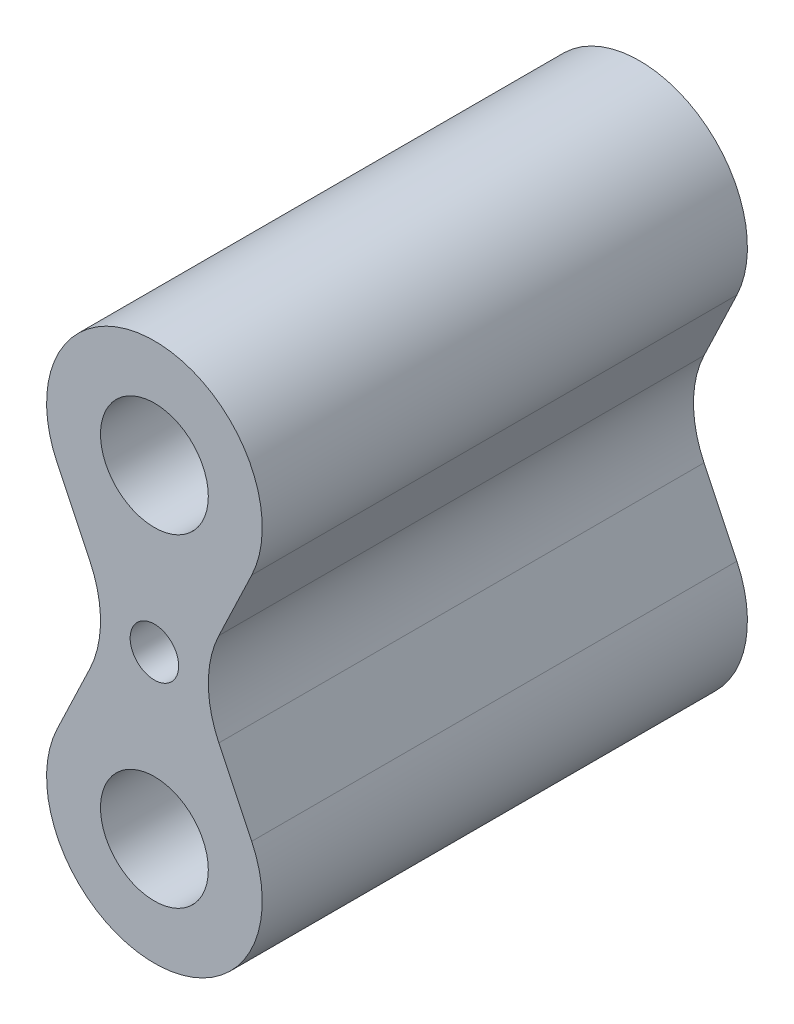
ISO-10303-21;
HEADER;
FILE_DESCRIPTION(('STEP AP214'),'2;1');
FILE_NAME('part.step','',(''),(''),'','','');
FILE_SCHEMA(('AUTOMOTIVE_DESIGN { 1 0 10303 214 1 1 1 1 }'));
ENDSEC;
DATA;
#1=APPLICATION_CONTEXT('core data for automotive mechanical design processes');
#2=APPLICATION_PROTOCOL_DEFINITION('international standard','automotive_design',2000,#1);
#3=PRODUCT_CONTEXT('',#1,'mechanical');
#4=PRODUCT('Part','Part','',(#3));
#5=PRODUCT_RELATED_PRODUCT_CATEGORY('part','',(#4));
#6=PRODUCT_DEFINITION_FORMATION('','',#4);
#7=PRODUCT_DEFINITION_CONTEXT('part definition',#1,'design');
#8=PRODUCT_DEFINITION('design','',#6,#7);
#9=PRODUCT_DEFINITION_SHAPE('','',#8);
#10=(LENGTH_UNIT() NAMED_UNIT(*) SI_UNIT(.MILLI.,.METRE.));
#11=(NAMED_UNIT(*) PLANE_ANGLE_UNIT() SI_UNIT($,.RADIAN.));
#12=(NAMED_UNIT(*) SI_UNIT($,.STERADIAN.) SOLID_ANGLE_UNIT());
#13=UNCERTAINTY_MEASURE_WITH_UNIT(LENGTH_MEASURE(1.E-05),#10,'distance_accuracy_value','');
#14=(GEOMETRIC_REPRESENTATION_CONTEXT(3) GLOBAL_UNCERTAINTY_ASSIGNED_CONTEXT((#13)) GLOBAL_UNIT_ASSIGNED_CONTEXT((#10,
#11,#12)) REPRESENTATION_CONTEXT('',''));
#15=CARTESIAN_POINT('',(0.,0.,0.));
#16=DIRECTION('',(0.,0.,1.));
#17=DIRECTION('',(1.,0.,0.));
#18=AXIS2_PLACEMENT_3D('',#15,#16,#17);
#19=CARTESIAN_POINT('',(0.,30.,45.));
#20=DIRECTION('',(0.,0.,1.));
#21=DIRECTION('',(1.,0.,0.));
#22=AXIS2_PLACEMENT_3D('',#19,#20,#21);
#23=PLANE('',#22);
#24=CARTESIAN_POINT('',(0.,0.,45.));
#25=DIRECTION('',(0.,0.,1.));
#26=DIRECTION('',(1.,0.,0.));
#27=AXIS2_PLACEMENT_3D('',#24,#25,#26);
#28=CIRCLE('',#27,4.49999999999999);
#29=CARTESIAN_POINT('',(4.49999999999999,0.,45.));
#30=VERTEX_POINT('',#29);
#31=EDGE_CURVE('E194',#30,#30,#28,.T.);
#32=ORIENTED_EDGE('',*,*,#31,.F.);
#33=EDGE_LOOP('',(#32));
#34=FACE_BOUND('',#33,.T.);
#35=CARTESIAN_POINT('',(0.,30.,45.));
#36=DIRECTION('',(0.,0.,1.));
#37=DIRECTION('',(1.,0.,0.));
#38=AXIS2_PLACEMENT_3D('',#35,#36,#37);
#39=CIRCLE('',#38,10.);
#40=CARTESIAN_POINT('',(10.,30.,45.));
#41=VERTEX_POINT('',#40);
#42=EDGE_CURVE('E135',#41,#41,#39,.T.);
#43=ORIENTED_EDGE('',*,*,#42,.F.);
#44=EDGE_LOOP('',(#43));
#45=FACE_BOUND('',#44,.T.);
#46=CARTESIAN_POINT('',(0.,30.,45.));
#47=DIRECTION('',(0.,0.,1.));
#48=DIRECTION('',(1.,0.,0.));
#49=AXIS2_PLACEMENT_3D('',#46,#47,#48);
#50=CIRCLE('',#49,20.);
#51=CARTESIAN_POINT('',(18.0473785412436,21.380711874577,45.));
#52=VERTEX_POINT('',#51);
#53=CARTESIAN_POINT('',(-18.0473785412436,21.380711874577,45.));
#54=VERTEX_POINT('',#53);
#55=EDGE_CURVE('E146',#52,#54,#50,.T.);
#56=ORIENTED_EDGE('',*,*,#55,.T.);
#57=DIRECTION('',(0.430964406271149,-0.902368927062183,0.));
#58=VECTOR('',#57,1.);
#59=CARTESIAN_POINT('',(-18.0473785412436,21.380711874577,45.));
#60=LINE('',#59,#58);
#61=CARTESIAN_POINT('',(-11.9526214587564,8.61928812542301,45.));
#62=VERTEX_POINT('',#61);
#63=EDGE_CURVE('E94',#54,#62,#60,.T.);
#64=ORIENTED_EDGE('',*,*,#63,.T.);
#65=CARTESIAN_POINT('',(-30.,0.,45.));
#66=DIRECTION('',(0.,0.,-1.));
#67=DIRECTION('',(1.,0.,0.));
#68=AXIS2_PLACEMENT_3D('',#65,#66,#67);
#69=CIRCLE('',#68,20.);
#70=CARTESIAN_POINT('',(-11.9526214587564,-8.61928812542302,45.));
#71=VERTEX_POINT('',#70);
#72=EDGE_CURVE('E161',#62,#71,#69,.T.);
#73=ORIENTED_EDGE('',*,*,#72,.T.);
#74=DIRECTION('',(-0.430964406271151,-0.902368927062183,0.));
#75=VECTOR('',#74,1.);
#76=CARTESIAN_POINT('',(-11.9526214587563,-8.61928812542302,45.));
#77=LINE('',#76,#75);
#78=CARTESIAN_POINT('',(-18.0473785412436,-21.380711874577,45.));
#79=VERTEX_POINT('',#78);
#80=EDGE_CURVE('E174',#71,#79,#77,.T.);
#81=ORIENTED_EDGE('',*,*,#80,.T.);
#82=CARTESIAN_POINT('',(0.,-30.,45.));
#83=DIRECTION('',(0.,0.,1.));
#84=DIRECTION('',(1.,0.,0.));
#85=AXIS2_PLACEMENT_3D('',#82,#83,#84);
#86=CIRCLE('',#85,20.);
#87=CARTESIAN_POINT('',(18.0473785412436,-21.380711874577,45.));
#88=VERTEX_POINT('',#87);
#89=EDGE_CURVE('E113',#79,#88,#86,.T.);
#90=ORIENTED_EDGE('',*,*,#89,.T.);
#91=DIRECTION('',(-0.430964406271151,0.902368927062182,0.));
#92=VECTOR('',#91,1.);
#93=CARTESIAN_POINT('',(11.9526214587563,-8.61928812542302,45.));
#94=LINE('',#93,#92);
#95=CARTESIAN_POINT('',(11.9526214587563,-8.61928812542302,45.));
#96=VERTEX_POINT('',#95);
#97=EDGE_CURVE('E107',#88,#96,#94,.T.);
#98=ORIENTED_EDGE('',*,*,#97,.T.);
#99=CARTESIAN_POINT('',(30.,0.,45.));
#100=DIRECTION('',(0.,0.,-1.));
#101=DIRECTION('',(1.,0.,0.));
#102=AXIS2_PLACEMENT_3D('',#99,#100,#101);
#103=CIRCLE('',#102,20.);
#104=CARTESIAN_POINT('',(11.9526214587563,8.61928812542301,45.));
#105=VERTEX_POINT('',#104);
#106=EDGE_CURVE('E111',#96,#105,#103,.T.);
#107=ORIENTED_EDGE('',*,*,#106,.T.);
#108=DIRECTION('',(0.430964406271151,0.902368927062183,0.));
#109=VECTOR('',#108,1.);
#110=CARTESIAN_POINT('',(18.0473785412436,21.380711874577,45.));
#111=LINE('',#110,#109);
#112=EDGE_CURVE('E51',#105,#52,#111,.T.);
#113=ORIENTED_EDGE('',*,*,#112,.T.);
#114=EDGE_LOOP('',(#56,#64,#73,#81,#90,#98,#107,#113));
#115=FACE_BOUND('',#114,.T.);
#116=CARTESIAN_POINT('',(0.,-30.,45.));
#117=DIRECTION('',(0.,0.,1.));
#118=DIRECTION('',(1.,0.,0.));
#119=AXIS2_PLACEMENT_3D('',#116,#117,#118);
#120=CIRCLE('',#119,10.);
#121=CARTESIAN_POINT('',(10.,-30.,45.));
#122=VERTEX_POINT('',#121);
#123=EDGE_CURVE('E183',#122,#122,#120,.T.);
#124=ORIENTED_EDGE('',*,*,#123,.F.);
#125=EDGE_LOOP('',(#124));
#126=FACE_BOUND('',#125,.T.);
#127=ADVANCED_FACE('F34',(#34,#45,#115,#126),#23,.T.);
#128=CARTESIAN_POINT('',(0.,30.,-45.));
#129=DIRECTION('',(0.,0.,1.));
#130=DIRECTION('',(1.,0.,0.));
#131=AXIS2_PLACEMENT_3D('',#128,#129,#130);
#132=PLANE('',#131);
#133=CARTESIAN_POINT('',(0.,0.,-45.));
#134=DIRECTION('',(0.,0.,1.));
#135=DIRECTION('',(1.,0.,0.));
#136=AXIS2_PLACEMENT_3D('',#133,#134,#135);
#137=CIRCLE('',#136,4.49999999999998);
#138=CARTESIAN_POINT('',(4.49999999999998,0.,-45.));
#139=VERTEX_POINT('',#138);
#140=EDGE_CURVE('E189',#139,#139,#137,.T.);
#141=ORIENTED_EDGE('',*,*,#140,.T.);
#142=EDGE_LOOP('',(#141));
#143=FACE_BOUND('',#142,.T.);
#144=CARTESIAN_POINT('',(0.,30.,-45.));
#145=DIRECTION('',(0.,0.,1.));
#146=DIRECTION('',(1.,0.,0.));
#147=AXIS2_PLACEMENT_3D('',#144,#145,#146);
#148=CIRCLE('',#147,20.);
#149=CARTESIAN_POINT('',(18.0473785412436,21.380711874577,-45.));
#150=VERTEX_POINT('',#149);
#151=CARTESIAN_POINT('',(-18.0473785412436,21.380711874577,-45.));
#152=VERTEX_POINT('',#151);
#153=EDGE_CURVE('E131',#150,#152,#148,.T.);
#154=ORIENTED_EDGE('',*,*,#153,.F.);
#155=DIRECTION('',(0.430964406271151,0.902368927062183,0.));
#156=VECTOR('',#155,1.);
#157=CARTESIAN_POINT('',(18.0473785412436,21.380711874577,-45.));
#158=LINE('',#157,#156);
#159=CARTESIAN_POINT('',(11.9526214587563,8.61928812542301,-45.));
#160=VERTEX_POINT('',#159);
#161=EDGE_CURVE('E86',#160,#150,#158,.T.);
#162=ORIENTED_EDGE('',*,*,#161,.F.);
#163=CARTESIAN_POINT('',(30.,0.,-45.));
#164=DIRECTION('',(0.,0.,-1.));
#165=DIRECTION('',(1.,0.,0.));
#166=AXIS2_PLACEMENT_3D('',#163,#164,#165);
#167=CIRCLE('',#166,20.);
#168=CARTESIAN_POINT('',(11.9526214587563,-8.61928812542302,-45.));
#169=VERTEX_POINT('',#168);
#170=EDGE_CURVE('E80',#169,#160,#167,.T.);
#171=ORIENTED_EDGE('',*,*,#170,.F.);
#172=DIRECTION('',(-0.430964406271151,0.902368927062182,0.));
#173=VECTOR('',#172,1.);
#174=CARTESIAN_POINT('',(11.9526214587563,-8.61928812542302,-45.));
#175=LINE('',#174,#173);
#176=CARTESIAN_POINT('',(18.0473785412436,-21.380711874577,-45.));
#177=VERTEX_POINT('',#176);
#178=EDGE_CURVE('E121',#177,#169,#175,.T.);
#179=ORIENTED_EDGE('',*,*,#178,.F.);
#180=CARTESIAN_POINT('',(0.,-30.,-45.));
#181=DIRECTION('',(0.,0.,1.));
#182=DIRECTION('',(1.,0.,0.));
#183=AXIS2_PLACEMENT_3D('',#180,#181,#182);
#184=CIRCLE('',#183,20.);
#185=CARTESIAN_POINT('',(-18.0473785412436,-21.380711874577,-45.));
#186=VERTEX_POINT('',#185);
#187=EDGE_CURVE('E141',#186,#177,#184,.T.);
#188=ORIENTED_EDGE('',*,*,#187,.F.);
#189=DIRECTION('',(-0.430964406271151,-0.902368927062183,0.));
#190=VECTOR('',#189,1.);
#191=CARTESIAN_POINT('',(-11.9526214587563,-8.61928812542302,-45.));
#192=LINE('',#191,#190);
#193=CARTESIAN_POINT('',(-11.9526214587564,-8.61928812542302,-45.));
#194=VERTEX_POINT('',#193);
#195=EDGE_CURVE('E139',#194,#186,#192,.T.);
#196=ORIENTED_EDGE('',*,*,#195,.F.);
#197=CARTESIAN_POINT('',(-30.,0.,-45.));
#198=DIRECTION('',(0.,0.,-1.));
#199=DIRECTION('',(1.,0.,0.));
#200=AXIS2_PLACEMENT_3D('',#197,#198,#199);
#201=CIRCLE('',#200,20.);
#202=CARTESIAN_POINT('',(-11.9526214587564,8.61928812542301,-45.));
#203=VERTEX_POINT('',#202);
#204=EDGE_CURVE('E137',#203,#194,#201,.T.);
#205=ORIENTED_EDGE('',*,*,#204,.F.);
#206=DIRECTION('',(0.430964406271149,-0.902368927062183,0.));
#207=VECTOR('',#206,1.);
#208=CARTESIAN_POINT('',(-18.0473785412436,21.380711874577,-45.));
#209=LINE('',#208,#207);
#210=EDGE_CURVE('E134',#152,#203,#209,.T.);
#211=ORIENTED_EDGE('',*,*,#210,.F.);
#212=EDGE_LOOP('',(#154,#162,#171,#179,#188,#196,#205,#211));
#213=FACE_BOUND('',#212,.T.);
#214=CARTESIAN_POINT('',(0.,30.,-45.));
#215=DIRECTION('',(0.,0.,1.));
#216=DIRECTION('',(1.,0.,0.));
#217=AXIS2_PLACEMENT_3D('',#214,#215,#216);
#218=CIRCLE('',#217,10.);
#219=CARTESIAN_POINT('',(10.,30.,-45.));
#220=VERTEX_POINT('',#219);
#221=EDGE_CURVE('E180',#220,#220,#218,.T.);
#222=ORIENTED_EDGE('',*,*,#221,.T.);
#223=EDGE_LOOP('',(#222));
#224=FACE_BOUND('',#223,.T.);
#225=CARTESIAN_POINT('',(0.,-30.,-45.));
#226=DIRECTION('',(0.,0.,1.));
#227=DIRECTION('',(1.,0.,0.));
#228=AXIS2_PLACEMENT_3D('',#225,#226,#227);
#229=CIRCLE('',#228,10.);
#230=CARTESIAN_POINT('',(10.,-30.,-45.));
#231=VERTEX_POINT('',#230);
#232=EDGE_CURVE('E186',#231,#231,#229,.T.);
#233=ORIENTED_EDGE('',*,*,#232,.T.);
#234=EDGE_LOOP('',(#233));
#235=FACE_BOUND('',#234,.T.);
#236=ADVANCED_FACE('F165',(#143,#213,#224,#235),#132,.F.);
#237=CARTESIAN_POINT('',(0.,30.,45.));
#238=DIRECTION('',(0.,0.,-1.));
#239=DIRECTION('',(-1.,0.,0.));
#240=AXIS2_PLACEMENT_3D('',#237,#238,#239);
#241=CYLINDRICAL_SURFACE('',#240,20.);
#242=ORIENTED_EDGE('',*,*,#153,.T.);
#243=DIRECTION('',(0.,0.,-1.));
#244=VECTOR('',#243,1.);
#245=CARTESIAN_POINT('',(-18.0473785412436,21.380711874577,45.));
#246=LINE('',#245,#244);
#247=EDGE_CURVE('E11',#54,#152,#246,.T.);
#248=ORIENTED_EDGE('',*,*,#247,.F.);
#249=ORIENTED_EDGE('',*,*,#55,.F.);
#250=DIRECTION('',(0.,0.,-1.));
#251=VECTOR('',#250,1.);
#252=CARTESIAN_POINT('',(18.0473785412436,21.380711874577,45.));
#253=LINE('',#252,#251);
#254=EDGE_CURVE('E127',#52,#150,#253,.T.);
#255=ORIENTED_EDGE('',*,*,#254,.T.);
#256=EDGE_LOOP('',(#242,#248,#249,#255));
#257=FACE_BOUND('',#256,.T.);
#258=ADVANCED_FACE('F36',(#257),#241,.T.);
#259=CARTESIAN_POINT('',(-18.0473785412436,21.380711874577,45.));
#260=DIRECTION('',(0.902368927062183,0.430964406271149,0.));
#261=DIRECTION('',(-0.430964406271149,0.902368927062183,0.));
#262=AXIS2_PLACEMENT_3D('',#259,#260,#261);
#263=PLANE('',#262);
#264=ORIENTED_EDGE('',*,*,#210,.T.);
#265=DIRECTION('',(0.,0.,-1.));
#266=VECTOR('',#265,1.);
#267=CARTESIAN_POINT('',(-11.9526214587564,8.61928812542301,45.));
#268=LINE('',#267,#266);
#269=EDGE_CURVE('E43',#62,#203,#268,.T.);
#270=ORIENTED_EDGE('',*,*,#269,.F.);
#271=ORIENTED_EDGE('',*,*,#63,.F.);
#272=ORIENTED_EDGE('',*,*,#247,.T.);
#273=EDGE_LOOP('',(#264,#270,#271,#272));
#274=FACE_BOUND('',#273,.T.);
#275=ADVANCED_FACE('F238',(#274),#263,.F.);
#276=CARTESIAN_POINT('',(-30.,0.,45.));
#277=DIRECTION('',(0.,0.,-1.));
#278=DIRECTION('',(-1.,0.,0.));
#279=AXIS2_PLACEMENT_3D('',#276,#277,#278);
#280=CYLINDRICAL_SURFACE('',#279,20.);
#281=ORIENTED_EDGE('',*,*,#204,.T.);
#282=DIRECTION('',(0.,0.,-1.));
#283=VECTOR('',#282,1.);
#284=CARTESIAN_POINT('',(-11.9526214587564,-8.61928812542302,45.));
#285=LINE('',#284,#283);
#286=EDGE_CURVE('E153',#71,#194,#285,.T.);
#287=ORIENTED_EDGE('',*,*,#286,.F.);
#288=ORIENTED_EDGE('',*,*,#72,.F.);
#289=ORIENTED_EDGE('',*,*,#269,.T.);
#290=EDGE_LOOP('',(#281,#287,#288,#289));
#291=FACE_BOUND('',#290,.T.);
#292=ADVANCED_FACE('F159',(#291),#280,.F.);
#293=CARTESIAN_POINT('',(-11.9526214587563,-8.61928812542302,45.));
#294=DIRECTION('',(0.902368927062183,-0.430964406271151,0.));
#295=DIRECTION('',(0.430964406271151,0.902368927062183,0.));
#296=AXIS2_PLACEMENT_3D('',#293,#294,#295);
#297=PLANE('',#296);
#298=ORIENTED_EDGE('',*,*,#195,.T.);
#299=DIRECTION('',(0.,0.,-1.));
#300=VECTOR('',#299,1.);
#301=CARTESIAN_POINT('',(-18.0473785412436,-21.380711874577,45.));
#302=LINE('',#301,#300);
#303=EDGE_CURVE('E150',#79,#186,#302,.T.);
#304=ORIENTED_EDGE('',*,*,#303,.F.);
#305=ORIENTED_EDGE('',*,*,#80,.F.);
#306=ORIENTED_EDGE('',*,*,#286,.T.);
#307=EDGE_LOOP('',(#298,#304,#305,#306));
#308=FACE_BOUND('',#307,.T.);
#309=ADVANCED_FACE('F170',(#308),#297,.F.);
#310=CARTESIAN_POINT('',(0.,-30.,45.));
#311=DIRECTION('',(0.,0.,-1.));
#312=DIRECTION('',(-1.,0.,0.));
#313=AXIS2_PLACEMENT_3D('',#310,#311,#312);
#314=CYLINDRICAL_SURFACE('',#313,20.);
#315=ORIENTED_EDGE('',*,*,#187,.T.);
#316=DIRECTION('',(0.,0.,-1.));
#317=VECTOR('',#316,1.);
#318=CARTESIAN_POINT('',(18.0473785412436,-21.380711874577,45.));
#319=LINE('',#318,#317);
#320=EDGE_CURVE('E122',#88,#177,#319,.T.);
#321=ORIENTED_EDGE('',*,*,#320,.F.);
#322=ORIENTED_EDGE('',*,*,#89,.F.);
#323=ORIENTED_EDGE('',*,*,#303,.T.);
#324=EDGE_LOOP('',(#315,#321,#322,#323));
#325=FACE_BOUND('',#324,.T.);
#326=ADVANCED_FACE('F173',(#325),#314,.T.);
#327=CARTESIAN_POINT('',(11.9526214587563,-8.61928812542302,45.));
#328=DIRECTION('',(-0.902368927062182,-0.430964406271151,0.));
#329=DIRECTION('',(0.430964406271151,-0.902368927062182,0.));
#330=AXIS2_PLACEMENT_3D('',#327,#328,#329);
#331=PLANE('',#330);
#332=ORIENTED_EDGE('',*,*,#178,.T.);
#333=DIRECTION('',(0.,0.,-1.));
#334=VECTOR('',#333,1.);
#335=CARTESIAN_POINT('',(11.9526214587563,-8.61928812542302,45.));
#336=LINE('',#335,#334);
#337=EDGE_CURVE('E118',#96,#169,#336,.T.);
#338=ORIENTED_EDGE('',*,*,#337,.F.);
#339=ORIENTED_EDGE('',*,*,#97,.F.);
#340=ORIENTED_EDGE('',*,*,#320,.T.);
#341=EDGE_LOOP('',(#332,#338,#339,#340));
#342=FACE_BOUND('',#341,.T.);
#343=ADVANCED_FACE('F119',(#342),#331,.F.);
#344=CARTESIAN_POINT('',(30.,0.,45.));
#345=DIRECTION('',(0.,0.,-1.));
#346=DIRECTION('',(-1.,0.,0.));
#347=AXIS2_PLACEMENT_3D('',#344,#345,#346);
#348=CYLINDRICAL_SURFACE('',#347,20.);
#349=ORIENTED_EDGE('',*,*,#170,.T.);
#350=DIRECTION('',(0.,0.,-1.));
#351=VECTOR('',#350,1.);
#352=CARTESIAN_POINT('',(11.9526214587563,8.61928812542301,45.));
#353=LINE('',#352,#351);
#354=EDGE_CURVE('E123',#105,#160,#353,.T.);
#355=ORIENTED_EDGE('',*,*,#354,.F.);
#356=ORIENTED_EDGE('',*,*,#106,.F.);
#357=ORIENTED_EDGE('',*,*,#337,.T.);
#358=EDGE_LOOP('',(#349,#355,#356,#357));
#359=FACE_BOUND('',#358,.T.);
#360=ADVANCED_FACE('F125',(#359),#348,.F.);
#361=CARTESIAN_POINT('',(18.0473785412436,21.380711874577,45.));
#362=DIRECTION('',(-0.902368927062183,0.430964406271151,0.));
#363=DIRECTION('',(-0.430964406271151,-0.902368927062183,0.));
#364=AXIS2_PLACEMENT_3D('',#361,#362,#363);
#365=PLANE('',#364);
#366=ORIENTED_EDGE('',*,*,#161,.T.);
#367=ORIENTED_EDGE('',*,*,#254,.F.);
#368=ORIENTED_EDGE('',*,*,#112,.F.);
#369=ORIENTED_EDGE('',*,*,#354,.T.);
#370=EDGE_LOOP('',(#366,#367,#368,#369));
#371=FACE_BOUND('',#370,.T.);
#372=ADVANCED_FACE('F209',(#371),#365,.F.);
#373=CARTESIAN_POINT('',(0.,30.,45.));
#374=DIRECTION('',(0.,0.,-1.));
#375=DIRECTION('',(-1.,0.,0.));
#376=AXIS2_PLACEMENT_3D('',#373,#374,#375);
#377=CYLINDRICAL_SURFACE('',#376,10.);
#378=ORIENTED_EDGE('',*,*,#42,.T.);
#379=EDGE_LOOP('',(#378));
#380=FACE_BOUND('',#379,.T.);
#381=ORIENTED_EDGE('',*,*,#221,.F.);
#382=EDGE_LOOP('',(#381));
#383=FACE_BOUND('',#382,.T.);
#384=ADVANCED_FACE('F205',(#380,#383),#377,.F.);
#385=CARTESIAN_POINT('',(0.,-30.,45.));
#386=DIRECTION('',(0.,0.,-1.));
#387=DIRECTION('',(-1.,0.,0.));
#388=AXIS2_PLACEMENT_3D('',#385,#386,#387);
#389=CYLINDRICAL_SURFACE('',#388,10.);
#390=ORIENTED_EDGE('',*,*,#123,.T.);
#391=EDGE_LOOP('',(#390));
#392=FACE_BOUND('',#391,.T.);
#393=ORIENTED_EDGE('',*,*,#232,.F.);
#394=EDGE_LOOP('',(#393));
#395=FACE_BOUND('',#394,.T.);
#396=ADVANCED_FACE('F208',(#392,#395),#389,.F.);
#397=CARTESIAN_POINT('',(0.,0.,45.));
#398=DIRECTION('',(0.,0.,1.));
#399=DIRECTION('',(1.,0.,0.));
#400=AXIS2_PLACEMENT_3D('',#397,#398,#399);
#401=CYLINDRICAL_SURFACE('',#400,4.49999999999998);
#402=ORIENTED_EDGE('',*,*,#140,.F.);
#403=EDGE_LOOP('',(#402));
#404=FACE_BOUND('',#403,.T.);
#405=ORIENTED_EDGE('',*,*,#31,.T.);
#406=EDGE_LOOP('',(#405));
#407=FACE_BOUND('',#406,.T.);
#408=ADVANCED_FACE('F198',(#404,#407),#401,.F.);
#409=CLOSED_SHELL('',(#127,#236,#258,#275,#292,#309,#326,#343,#360,#372,#384,#396,#408));
#410=MANIFOLD_SOLID_BREP('B2',#409);
#411=ADVANCED_BREP_SHAPE_REPRESENTATION('',(#18,#410),#14);
#412=SHAPE_DEFINITION_REPRESENTATION(#9,#411);
ENDSEC;
END-ISO-10303-21;
